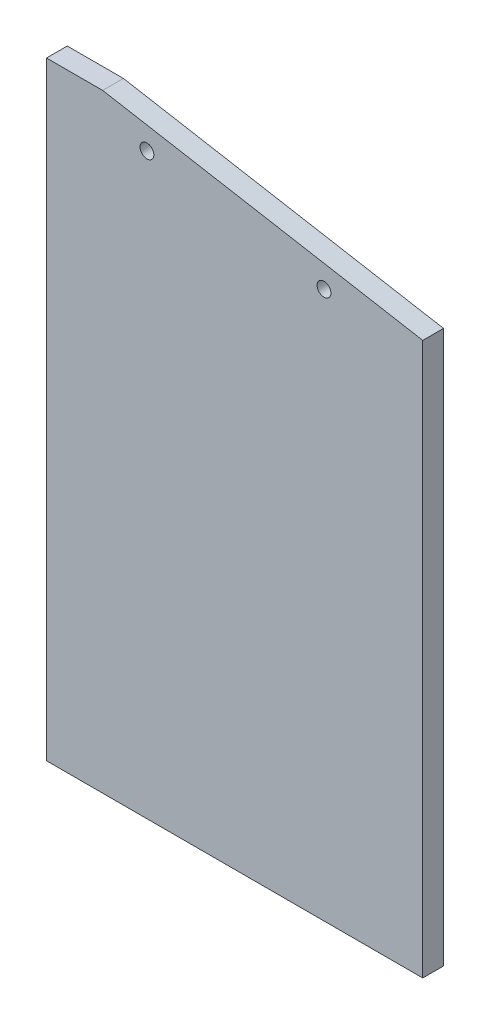
ISO-10303-21;
HEADER;
FILE_DESCRIPTION(('STEP AP214'),'2;1');
FILE_NAME('part.step','',(''),(''),'','','');
FILE_SCHEMA(('AUTOMOTIVE_DESIGN { 1 0 10303 214 1 1 1 1 }'));
ENDSEC;
DATA;
#1=APPLICATION_CONTEXT('core data for automotive mechanical design processes');
#2=APPLICATION_PROTOCOL_DEFINITION('international standard','automotive_design',2000,#1);
#3=PRODUCT_CONTEXT('',#1,'mechanical');
#4=PRODUCT('Part','Part','',(#3));
#5=PRODUCT_RELATED_PRODUCT_CATEGORY('part','',(#4));
#6=PRODUCT_DEFINITION_FORMATION('','',#4);
#7=PRODUCT_DEFINITION_CONTEXT('part definition',#1,'design');
#8=PRODUCT_DEFINITION('design','',#6,#7);
#9=PRODUCT_DEFINITION_SHAPE('','',#8);
#10=(LENGTH_UNIT() NAMED_UNIT(*) SI_UNIT(.MILLI.,.METRE.));
#11=(NAMED_UNIT(*) PLANE_ANGLE_UNIT() SI_UNIT($,.RADIAN.));
#12=(NAMED_UNIT(*) SI_UNIT($,.STERADIAN.) SOLID_ANGLE_UNIT());
#13=UNCERTAINTY_MEASURE_WITH_UNIT(LENGTH_MEASURE(1.E-05),#10,'distance_accuracy_value','');
#14=(GEOMETRIC_REPRESENTATION_CONTEXT(3) GLOBAL_UNCERTAINTY_ASSIGNED_CONTEXT((#13)) GLOBAL_UNIT_ASSIGNED_CONTEXT((#10,
#11,#12)) REPRESENTATION_CONTEXT('',''));
#15=CARTESIAN_POINT('',(0.,0.,0.));
#16=DIRECTION('',(0.,0.,1.));
#17=DIRECTION('',(1.,0.,0.));
#18=AXIS2_PLACEMENT_3D('',#15,#16,#17);
#19=CARTESIAN_POINT('',(-64.8764424177563,183.337887464952,11.90625));
#20=DIRECTION('',(1.,0.,0.));
#21=DIRECTION('',(0.,1.,0.));
#22=AXIS2_PLACEMENT_3D('',#19,#20,#21);
#23=PLANE('',#22);
#24=DIRECTION('',(0.,-1.,0.));
#25=VECTOR('',#24,1.);
#26=CARTESIAN_POINT('',(-64.8764424177563,183.337887464952,0.));
#27=LINE('',#26,#25);
#28=CARTESIAN_POINT('',(-64.8764424177563,183.337887464952,0.));
#29=VERTEX_POINT('',#28);
#30=CARTESIAN_POINT('',(-64.8764424177563,-165.912112535048,0.));
#31=VERTEX_POINT('',#30);
#32=EDGE_CURVE('E98',#29,#31,#27,.T.);
#33=ORIENTED_EDGE('',*,*,#32,.T.);
#34=DIRECTION('',(0.,0.,-1.));
#35=VECTOR('',#34,1.);
#36=CARTESIAN_POINT('',(-64.8764424177564,-165.912112535048,11.90625));
#37=LINE('',#36,#35);
#38=CARTESIAN_POINT('',(-64.8764424177564,-165.912112535048,11.90625));
#39=VERTEX_POINT('',#38);
#40=EDGE_CURVE('E48',#39,#31,#37,.T.);
#41=ORIENTED_EDGE('',*,*,#40,.F.);
#42=DIRECTION('',(0.,-1.,0.));
#43=VECTOR('',#42,1.);
#44=CARTESIAN_POINT('',(-64.8764424177563,183.337887464952,11.90625));
#45=LINE('',#44,#43);
#46=CARTESIAN_POINT('',(-64.8764424177563,183.337887464952,11.90625));
#47=VERTEX_POINT('',#46);
#48=EDGE_CURVE('E96',#47,#39,#45,.T.);
#49=ORIENTED_EDGE('',*,*,#48,.F.);
#50=DIRECTION('',(0.,0.,-1.));
#51=VECTOR('',#50,1.);
#52=CARTESIAN_POINT('',(-64.8764424177563,183.337887464952,11.90625));
#53=LINE('',#52,#51);
#54=EDGE_CURVE('E113',#47,#29,#53,.T.);
#55=ORIENTED_EDGE('',*,*,#54,.T.);
#56=EDGE_LOOP('',(#33,#41,#49,#55));
#57=FACE_BOUND('',#56,.T.);
#58=ADVANCED_FACE('F34',(#57),#23,.F.);
#59=CARTESIAN_POINT('',(151.023557582244,150.952887464952,11.90625));
#60=DIRECTION('',(-1.,0.,0.));
#61=DIRECTION('',(0.,-1.,0.));
#62=AXIS2_PLACEMENT_3D('',#59,#60,#61);
#63=PLANE('',#62);
#64=DIRECTION('',(0.,1.,0.));
#65=VECTOR('',#64,1.);
#66=CARTESIAN_POINT('',(151.023557582244,150.952887464952,11.90625));
#67=LINE('',#66,#65);
#68=CARTESIAN_POINT('',(151.023557582244,-165.912112535048,11.90625));
#69=VERTEX_POINT('',#68);
#70=CARTESIAN_POINT('',(151.023557582244,150.952887464952,11.90625));
#71=VERTEX_POINT('',#70);
#72=EDGE_CURVE('E79',#69,#71,#67,.T.);
#73=ORIENTED_EDGE('',*,*,#72,.F.);
#74=DIRECTION('',(0.,0.,-1.));
#75=VECTOR('',#74,1.);
#76=CARTESIAN_POINT('',(151.023557582244,-165.912112535048,11.90625));
#77=LINE('',#76,#75);
#78=CARTESIAN_POINT('',(151.023557582244,-165.912112535048,0.));
#79=VERTEX_POINT('',#78);
#80=EDGE_CURVE('E90',#69,#79,#77,.T.);
#81=ORIENTED_EDGE('',*,*,#80,.T.);
#82=DIRECTION('',(0.,1.,0.));
#83=VECTOR('',#82,1.);
#84=CARTESIAN_POINT('',(151.023557582244,150.952887464952,0.));
#85=LINE('',#84,#83);
#86=CARTESIAN_POINT('',(151.023557582244,150.952887464952,0.));
#87=VERTEX_POINT('',#86);
#88=EDGE_CURVE('E115',#79,#87,#85,.T.);
#89=ORIENTED_EDGE('',*,*,#88,.T.);
#90=DIRECTION('',(0.,0.,-1.));
#91=VECTOR('',#90,1.);
#92=CARTESIAN_POINT('',(151.023557582244,150.952887464952,11.90625));
#93=LINE('',#92,#91);
#94=EDGE_CURVE('E11',#71,#87,#93,.T.);
#95=ORIENTED_EDGE('',*,*,#94,.F.);
#96=EDGE_LOOP('',(#73,#81,#89,#95));
#97=FACE_BOUND('',#96,.T.);
#98=ADVANCED_FACE('F156',(#97),#63,.F.);
#99=CARTESIAN_POINT('',(151.023557582244,150.952887464952,11.90625));
#100=DIRECTION('',(-0.173648177666923,-0.984807753012209,0.));
#101=DIRECTION('',(0.984807753012209,-0.173648177666923,0.));
#102=AXIS2_PLACEMENT_3D('',#99,#100,#101);
#103=PLANE('',#102);
#104=DIRECTION('',(-0.984807753012209,0.173648177666923,0.));
#105=VECTOR('',#104,1.);
#106=CARTESIAN_POINT('',(151.023557582244,150.952887464952,0.));
#107=LINE('',#106,#105);
#108=CARTESIAN_POINT('',(-32.640904146084,183.337887464952,0.));
#109=VERTEX_POINT('',#108);
#110=EDGE_CURVE('E105',#87,#109,#107,.T.);
#111=ORIENTED_EDGE('',*,*,#110,.T.);
#112=DIRECTION('',(0.,0.,-1.));
#113=VECTOR('',#112,1.);
#114=CARTESIAN_POINT('',(-32.640904146084,183.337887464952,11.90625));
#115=LINE('',#114,#113);
#116=CARTESIAN_POINT('',(-32.640904146084,183.337887464952,11.90625));
#117=VERTEX_POINT('',#116);
#118=EDGE_CURVE('E41',#117,#109,#115,.T.);
#119=ORIENTED_EDGE('',*,*,#118,.F.);
#120=DIRECTION('',(-0.984807753012209,0.173648177666923,0.));
#121=VECTOR('',#120,1.);
#122=CARTESIAN_POINT('',(151.023557582244,150.952887464952,11.90625));
#123=LINE('',#122,#121);
#124=EDGE_CURVE('E103',#71,#117,#123,.T.);
#125=ORIENTED_EDGE('',*,*,#124,.F.);
#126=ORIENTED_EDGE('',*,*,#94,.T.);
#127=EDGE_LOOP('',(#111,#119,#125,#126));
#128=FACE_BOUND('',#127,.T.);
#129=ADVANCED_FACE('F160',(#128),#103,.F.);
#130=CARTESIAN_POINT('',(-64.8764424177563,183.337887464952,11.90625));
#131=DIRECTION('',(0.,-1.,0.));
#132=DIRECTION('',(1.,0.,0.));
#133=AXIS2_PLACEMENT_3D('',#130,#131,#132);
#134=PLANE('',#133);
#135=DIRECTION('',(-1.,0.,0.));
#136=VECTOR('',#135,1.);
#137=CARTESIAN_POINT('',(-64.8764424177563,183.337887464952,0.));
#138=LINE('',#137,#136);
#139=EDGE_CURVE('E74',#109,#29,#138,.T.);
#140=ORIENTED_EDGE('',*,*,#139,.T.);
#141=ORIENTED_EDGE('',*,*,#54,.F.);
#142=DIRECTION('',(-1.,0.,0.));
#143=VECTOR('',#142,1.);
#144=CARTESIAN_POINT('',(-64.8764424177563,183.337887464952,11.90625));
#145=LINE('',#144,#143);
#146=EDGE_CURVE('E57',#117,#47,#145,.T.);
#147=ORIENTED_EDGE('',*,*,#146,.F.);
#148=ORIENTED_EDGE('',*,*,#118,.T.);
#149=EDGE_LOOP('',(#140,#141,#147,#148));
#150=FACE_BOUND('',#149,.T.);
#151=ADVANCED_FACE('F119',(#150),#134,.F.);
#152=CARTESIAN_POINT('',(0.,0.,11.90625));
#153=DIRECTION('',(0.,0.,1.));
#154=DIRECTION('',(1.,0.,0.));
#155=AXIS2_PLACEMENT_3D('',#152,#153,#154);
#156=PLANE('',#155);
#157=DIRECTION('',(1.,0.,0.));
#158=VECTOR('',#157,1.);
#159=CARTESIAN_POINT('',(-64.8764424177564,-165.912112535048,11.90625));
#160=LINE('',#159,#158);
#161=EDGE_CURVE('E87',#39,#69,#160,.T.);
#162=ORIENTED_EDGE('',*,*,#161,.T.);
#163=ORIENTED_EDGE('',*,*,#72,.T.);
#164=ORIENTED_EDGE('',*,*,#124,.T.);
#165=ORIENTED_EDGE('',*,*,#146,.T.);
#166=ORIENTED_EDGE('',*,*,#48,.T.);
#167=EDGE_LOOP('',(#162,#163,#164,#165,#166));
#168=FACE_BOUND('',#167,.T.);
#169=CARTESIAN_POINT('',(94.359095853916,148.048442944029,11.90625));
#170=DIRECTION('',(0.,0.,1.));
#171=DIRECTION('',(1.,0.,0.));
#172=AXIS2_PLACEMENT_3D('',#169,#170,#171);
#173=CIRCLE('',#172,3.96874999999999);
#174=CARTESIAN_POINT('',(98.327845853916,148.048442944029,11.90625));
#175=VERTEX_POINT('',#174);
#176=EDGE_CURVE('E129',#175,#175,#173,.T.);
#177=ORIENTED_EDGE('',*,*,#176,.F.);
#178=EDGE_LOOP('',(#177));
#179=FACE_BOUND('',#178,.T.);
#180=CARTESIAN_POINT('',(-7.24090414608392,165.963264184008,11.90625));
#181=DIRECTION('',(0.,0.,1.));
#182=DIRECTION('',(1.,0.,0.));
#183=AXIS2_PLACEMENT_3D('',#180,#181,#182);
#184=CIRCLE('',#183,3.96874999999999);
#185=CARTESIAN_POINT('',(-3.27215414608393,165.963264184008,11.90625));
#186=VERTEX_POINT('',#185);
#187=EDGE_CURVE('E134',#186,#186,#184,.T.);
#188=ORIENTED_EDGE('',*,*,#187,.F.);
#189=EDGE_LOOP('',(#188));
#190=FACE_BOUND('',#189,.T.);
#191=ADVANCED_FACE('F100',(#168,#179,#190),#156,.T.);
#192=CARTESIAN_POINT('',(0.,0.,0.));
#193=DIRECTION('',(0.,0.,1.));
#194=DIRECTION('',(1.,0.,0.));
#195=AXIS2_PLACEMENT_3D('',#192,#193,#194);
#196=PLANE('',#195);
#197=CARTESIAN_POINT('',(94.359095853916,148.048442944029,0.));
#198=DIRECTION('',(0.,0.,1.));
#199=DIRECTION('',(1.,0.,0.));
#200=AXIS2_PLACEMENT_3D('',#197,#198,#199);
#201=CIRCLE('',#200,3.96874999999999);
#202=CARTESIAN_POINT('',(98.327845853916,148.048442944029,0.));
#203=VERTEX_POINT('',#202);
#204=EDGE_CURVE('E132',#203,#203,#201,.T.);
#205=ORIENTED_EDGE('',*,*,#204,.T.);
#206=EDGE_LOOP('',(#205));
#207=FACE_BOUND('',#206,.T.);
#208=CARTESIAN_POINT('',(-7.24090414608392,165.963264184008,0.));
#209=DIRECTION('',(0.,0.,1.));
#210=DIRECTION('',(1.,0.,0.));
#211=AXIS2_PLACEMENT_3D('',#208,#209,#210);
#212=CIRCLE('',#211,3.96875);
#213=CARTESIAN_POINT('',(-3.27215414608392,165.963264184008,0.));
#214=VERTEX_POINT('',#213);
#215=EDGE_CURVE('E108',#214,#214,#212,.T.);
#216=ORIENTED_EDGE('',*,*,#215,.T.);
#217=EDGE_LOOP('',(#216));
#218=FACE_BOUND('',#217,.T.);
#219=ORIENTED_EDGE('',*,*,#88,.F.);
#220=DIRECTION('',(1.,0.,0.));
#221=VECTOR('',#220,1.);
#222=CARTESIAN_POINT('',(-64.8764424177564,-165.912112535048,0.));
#223=LINE('',#222,#221);
#224=EDGE_CURVE('E91',#31,#79,#223,.T.);
#225=ORIENTED_EDGE('',*,*,#224,.F.);
#226=ORIENTED_EDGE('',*,*,#32,.F.);
#227=ORIENTED_EDGE('',*,*,#139,.F.);
#228=ORIENTED_EDGE('',*,*,#110,.F.);
#229=EDGE_LOOP('',(#219,#225,#226,#227,#228));
#230=FACE_BOUND('',#229,.T.);
#231=ADVANCED_FACE('F125',(#207,#218,#230),#196,.F.);
#232=CARTESIAN_POINT('',(-7.24090414608392,165.963264184008,11.90625));
#233=DIRECTION('',(0.,0.,1.));
#234=DIRECTION('',(1.,0.,0.));
#235=AXIS2_PLACEMENT_3D('',#232,#233,#234);
#236=CYLINDRICAL_SURFACE('',#235,3.96874999999999);
#237=ORIENTED_EDGE('',*,*,#215,.F.);
#238=EDGE_LOOP('',(#237));
#239=FACE_BOUND('',#238,.T.);
#240=ORIENTED_EDGE('',*,*,#187,.T.);
#241=EDGE_LOOP('',(#240));
#242=FACE_BOUND('',#241,.T.);
#243=ADVANCED_FACE('F142',(#239,#242),#236,.F.);
#244=CARTESIAN_POINT('',(94.359095853916,148.048442944029,11.90625));
#245=DIRECTION('',(0.,0.,1.));
#246=DIRECTION('',(1.,0.,0.));
#247=AXIS2_PLACEMENT_3D('',#244,#245,#246);
#248=CYLINDRICAL_SURFACE('',#247,3.96874999999999);
#249=ORIENTED_EDGE('',*,*,#204,.F.);
#250=EDGE_LOOP('',(#249));
#251=FACE_BOUND('',#250,.T.);
#252=ORIENTED_EDGE('',*,*,#176,.T.);
#253=EDGE_LOOP('',(#252));
#254=FACE_BOUND('',#253,.T.);
#255=ADVANCED_FACE('F144',(#251,#254),#248,.F.);
#256=CARTESIAN_POINT('',(-64.8764424177564,-165.912112535048,11.90625));
#257=DIRECTION('',(0.,1.,0.));
#258=DIRECTION('',(-1.,0.,0.));
#259=AXIS2_PLACEMENT_3D('',#256,#257,#258);
#260=PLANE('',#259);
#261=ORIENTED_EDGE('',*,*,#161,.F.);
#262=ORIENTED_EDGE('',*,*,#40,.T.);
#263=ORIENTED_EDGE('',*,*,#224,.T.);
#264=ORIENTED_EDGE('',*,*,#80,.F.);
#265=EDGE_LOOP('',(#261,#262,#263,#264));
#266=FACE_BOUND('',#265,.T.);
#267=ADVANCED_FACE('F88',(#266),#260,.F.);
#268=CLOSED_SHELL('',(#58,#98,#129,#151,#191,#231,#243,#255,#267));
#269=MANIFOLD_SOLID_BREP('B2',#268);
#270=ADVANCED_BREP_SHAPE_REPRESENTATION('',(#18,#269),#14);
#271=SHAPE_DEFINITION_REPRESENTATION(#9,#270);
ENDSEC;
END-ISO-10303-21;
